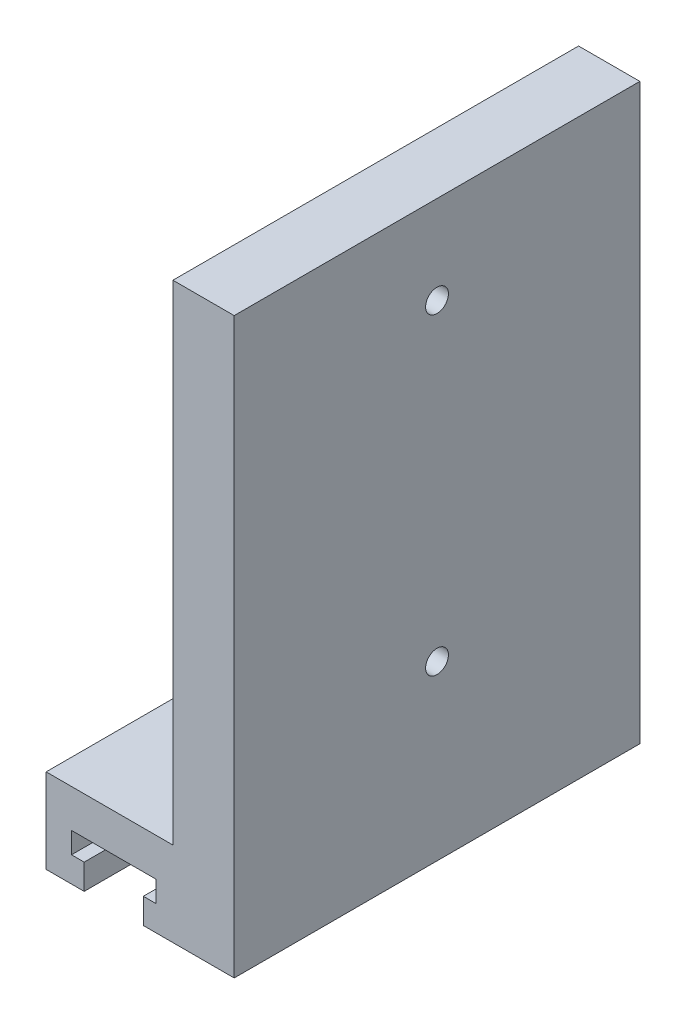
ISO-10303-21;
HEADER;
FILE_DESCRIPTION(('STEP AP214'),'2;1');
FILE_NAME('part.step','',(''),(''),'','','');
FILE_SCHEMA(('AUTOMOTIVE_DESIGN { 1 0 10303 214 1 1 1 1 }'));
ENDSEC;
DATA;
#1=APPLICATION_CONTEXT('core data for automotive mechanical design processes');
#2=APPLICATION_PROTOCOL_DEFINITION('international standard','automotive_design',2000,#1);
#3=PRODUCT_CONTEXT('',#1,'mechanical');
#4=PRODUCT('Part','Part','',(#3));
#5=PRODUCT_RELATED_PRODUCT_CATEGORY('part','',(#4));
#6=PRODUCT_DEFINITION_FORMATION('','',#4);
#7=PRODUCT_DEFINITION_CONTEXT('part definition',#1,'design');
#8=PRODUCT_DEFINITION('design','',#6,#7);
#9=PRODUCT_DEFINITION_SHAPE('','',#8);
#10=(LENGTH_UNIT() NAMED_UNIT(*) SI_UNIT(.MILLI.,.METRE.));
#11=(NAMED_UNIT(*) PLANE_ANGLE_UNIT() SI_UNIT($,.RADIAN.));
#12=(NAMED_UNIT(*) SI_UNIT($,.STERADIAN.) SOLID_ANGLE_UNIT());
#13=UNCERTAINTY_MEASURE_WITH_UNIT(LENGTH_MEASURE(1.E-05),#10,'distance_accuracy_value','');
#14=(GEOMETRIC_REPRESENTATION_CONTEXT(3) GLOBAL_UNCERTAINTY_ASSIGNED_CONTEXT((#13)) GLOBAL_UNIT_ASSIGNED_CONTEXT((#10,
#11,#12)) REPRESENTATION_CONTEXT('',''));
#15=CARTESIAN_POINT('',(0.,0.,0.));
#16=DIRECTION('',(0.,0.,1.));
#17=DIRECTION('',(1.,0.,0.));
#18=AXIS2_PLACEMENT_3D('',#15,#16,#17);
#19=CARTESIAN_POINT('',(-8.,13.,-38.));
#20=DIRECTION('',(-1.,0.,0.));
#21=DIRECTION('',(0.,0.,1.));
#22=AXIS2_PLACEMENT_3D('',#19,#20,#21);
#23=PLANE('',#22);
#24=DIRECTION('',(0.,-1.,0.));
#25=VECTOR('',#24,1.);
#26=CARTESIAN_POINT('',(-8.,13.,10.));
#27=LINE('',#26,#25);
#28=CARTESIAN_POINT('',(-8.,23.,10.));
#29=VERTEX_POINT('',#28);
#30=CARTESIAN_POINT('',(-8.,13.,10.));
#31=VERTEX_POINT('',#30);
#32=EDGE_CURVE('E170',#29,#31,#27,.T.);
#33=ORIENTED_EDGE('',*,*,#32,.F.);
#34=DIRECTION('',(0.,0.,1.));
#35=VECTOR('',#34,1.);
#36=CARTESIAN_POINT('',(-8.,23.,-38.));
#37=LINE('',#36,#35);
#38=CARTESIAN_POINT('',(-8.,23.,-38.));
#39=VERTEX_POINT('',#38);
#40=EDGE_CURVE('E11',#39,#29,#37,.T.);
#41=ORIENTED_EDGE('',*,*,#40,.F.);
#42=DIRECTION('',(0.,-1.,0.));
#43=VECTOR('',#42,1.);
#44=CARTESIAN_POINT('',(-8.,13.,-38.));
#45=LINE('',#44,#43);
#46=CARTESIAN_POINT('',(-8.,13.,-38.));
#47=VERTEX_POINT('',#46);
#48=EDGE_CURVE('E209',#39,#47,#45,.T.);
#49=ORIENTED_EDGE('',*,*,#48,.T.);
#50=DIRECTION('',(0.,0.,1.));
#51=VECTOR('',#50,1.);
#52=CARTESIAN_POINT('',(-8.,13.,-38.));
#53=LINE('',#52,#51);
#54=EDGE_CURVE('E40',#47,#31,#53,.T.);
#55=ORIENTED_EDGE('',*,*,#54,.T.);
#56=EDGE_LOOP('',(#33,#41,#49,#55));
#57=FACE_BOUND('',#56,.T.);
#58=ADVANCED_FACE('F37',(#57),#23,.T.);
#59=CARTESIAN_POINT('',(-8.,23.,-38.));
#60=DIRECTION('',(0.,1.,0.));
#61=DIRECTION('',(0.,0.,1.));
#62=AXIS2_PLACEMENT_3D('',#59,#60,#61);
#63=PLANE('',#62);
#64=CARTESIAN_POINT('',(-4.14598910758457E-13,23.,-14.0000000000004));
#65=DIRECTION('',(0.,1.,0.));
#66=DIRECTION('',(0.,0.,1.));
#67=AXIS2_PLACEMENT_3D('',#64,#65,#66);
#68=CIRCLE('',#67,1.35);
#69=CARTESIAN_POINT('',(-4.14598910758457E-13,23.,-12.6500000000004));
#70=VERTEX_POINT('',#69);
#71=EDGE_CURVE('E321',#70,#70,#68,.T.);
#72=ORIENTED_EDGE('',*,*,#71,.F.);
#73=EDGE_LOOP('',(#72));
#74=FACE_BOUND('',#73,.T.);
#75=DIRECTION('',(-1.,0.,0.));
#76=VECTOR('',#75,1.);
#77=CARTESIAN_POINT('',(-8.,23.,10.));
#78=LINE('',#77,#76);
#79=CARTESIAN_POINT('',(7.,23.,10.));
#80=VERTEX_POINT('',#79);
#81=EDGE_CURVE('E207',#80,#29,#78,.T.);
#82=ORIENTED_EDGE('',*,*,#81,.F.);
#83=DIRECTION('',(0.,0.,1.));
#84=VECTOR('',#83,1.);
#85=CARTESIAN_POINT('',(7.,23.,-38.));
#86=LINE('',#85,#84);
#87=CARTESIAN_POINT('',(7.,23.,-38.));
#88=VERTEX_POINT('',#87);
#89=EDGE_CURVE('E46',#88,#80,#86,.T.);
#90=ORIENTED_EDGE('',*,*,#89,.F.);
#91=DIRECTION('',(-1.,0.,0.));
#92=VECTOR('',#91,1.);
#93=CARTESIAN_POINT('',(-8.,23.,-38.));
#94=LINE('',#93,#92);
#95=EDGE_CURVE('E160',#88,#39,#94,.T.);
#96=ORIENTED_EDGE('',*,*,#95,.T.);
#97=ORIENTED_EDGE('',*,*,#40,.T.);
#98=EDGE_LOOP('',(#82,#90,#96,#97));
#99=FACE_BOUND('',#98,.T.);
#100=ADVANCED_FACE('F233',(#74,#99),#63,.T.);
#101=CARTESIAN_POINT('',(7.,23.,-38.));
#102=DIRECTION('',(-1.,0.,0.));
#103=DIRECTION('',(0.,0.,1.));
#104=AXIS2_PLACEMENT_3D('',#101,#102,#103);
#105=PLANE('',#104);
#106=CARTESIAN_POINT('',(7.,70.44,-14.));
#107=DIRECTION('',(-1.,0.,0.));
#108=DIRECTION('',(0.,0.,1.));
#109=AXIS2_PLACEMENT_3D('',#106,#107,#108);
#110=CIRCLE('',#109,1.34999999999999);
#111=CARTESIAN_POINT('',(7.,70.44,-12.65));
#112=VERTEX_POINT('',#111);
#113=EDGE_CURVE('E311',#112,#112,#110,.T.);
#114=ORIENTED_EDGE('',*,*,#113,.F.);
#115=EDGE_LOOP('',(#114));
#116=FACE_BOUND('',#115,.T.);
#117=CARTESIAN_POINT('',(7.,33.44,-14.));
#118=DIRECTION('',(-1.,0.,0.));
#119=DIRECTION('',(0.,0.,1.));
#120=AXIS2_PLACEMENT_3D('',#117,#118,#119);
#121=CIRCLE('',#120,1.34999999999999);
#122=CARTESIAN_POINT('',(7.,33.44,-12.65));
#123=VERTEX_POINT('',#122);
#124=EDGE_CURVE('E313',#123,#123,#121,.T.);
#125=ORIENTED_EDGE('',*,*,#124,.F.);
#126=EDGE_LOOP('',(#125));
#127=FACE_BOUND('',#126,.T.);
#128=DIRECTION('',(0.,-1.,0.));
#129=VECTOR('',#128,1.);
#130=CARTESIAN_POINT('',(7.,23.,10.));
#131=LINE('',#130,#129);
#132=CARTESIAN_POINT('',(7.,80.88,10.));
#133=VERTEX_POINT('',#132);
#134=EDGE_CURVE('E147',#133,#80,#131,.T.);
#135=ORIENTED_EDGE('',*,*,#134,.F.);
#136=DIRECTION('',(0.,0.,1.));
#137=VECTOR('',#136,1.);
#138=CARTESIAN_POINT('',(7.,80.88,-38.));
#139=LINE('',#138,#137);
#140=CARTESIAN_POINT('',(7.,80.88,-38.));
#141=VERTEX_POINT('',#140);
#142=EDGE_CURVE('E142',#141,#133,#139,.T.);
#143=ORIENTED_EDGE('',*,*,#142,.F.);
#144=DIRECTION('',(0.,-1.,0.));
#145=VECTOR('',#144,1.);
#146=CARTESIAN_POINT('',(7.,23.,-38.));
#147=LINE('',#146,#145);
#148=EDGE_CURVE('E145',#141,#88,#147,.T.);
#149=ORIENTED_EDGE('',*,*,#148,.T.);
#150=ORIENTED_EDGE('',*,*,#89,.T.);
#151=EDGE_LOOP('',(#135,#143,#149,#150));
#152=FACE_BOUND('',#151,.T.);
#153=ADVANCED_FACE('F144',(#116,#127,#152),#105,.T.);
#154=CARTESIAN_POINT('',(7.,80.88,-38.));
#155=DIRECTION('',(0.,1.,0.));
#156=DIRECTION('',(0.,0.,1.));
#157=AXIS2_PLACEMENT_3D('',#154,#155,#156);
#158=PLANE('',#157);
#159=DIRECTION('',(-1.,0.,0.));
#160=VECTOR('',#159,1.);
#161=CARTESIAN_POINT('',(7.,80.88,10.));
#162=LINE('',#161,#160);
#163=CARTESIAN_POINT('',(14.25,80.88,10.));
#164=VERTEX_POINT('',#163);
#165=EDGE_CURVE('E204',#164,#133,#162,.T.);
#166=ORIENTED_EDGE('',*,*,#165,.F.);
#167=DIRECTION('',(0.,0.,1.));
#168=VECTOR('',#167,1.);
#169=CARTESIAN_POINT('',(14.25,80.88,-38.));
#170=LINE('',#169,#168);
#171=CARTESIAN_POINT('',(14.25,80.88,-38.));
#172=VERTEX_POINT('',#171);
#173=EDGE_CURVE('E152',#172,#164,#170,.T.);
#174=ORIENTED_EDGE('',*,*,#173,.F.);
#175=DIRECTION('',(-1.,0.,0.));
#176=VECTOR('',#175,1.);
#177=CARTESIAN_POINT('',(7.,80.88,-38.));
#178=LINE('',#177,#176);
#179=EDGE_CURVE('E158',#172,#141,#178,.T.);
#180=ORIENTED_EDGE('',*,*,#179,.T.);
#181=ORIENTED_EDGE('',*,*,#142,.T.);
#182=EDGE_LOOP('',(#166,#174,#180,#181));
#183=FACE_BOUND('',#182,.T.);
#184=ADVANCED_FACE('F162',(#183),#158,.T.);
#185=CARTESIAN_POINT('',(14.25,13.,-38.));
#186=DIRECTION('',(1.,0.,0.));
#187=DIRECTION('',(0.,0.,-1.));
#188=AXIS2_PLACEMENT_3D('',#185,#186,#187);
#189=PLANE('',#188);
#190=CARTESIAN_POINT('',(14.25,70.44,-14.));
#191=DIRECTION('',(-1.,0.,0.));
#192=DIRECTION('',(0.,0.,1.));
#193=AXIS2_PLACEMENT_3D('',#190,#191,#192);
#194=CIRCLE('',#193,1.35);
#195=CARTESIAN_POINT('',(14.25,70.44,-12.65));
#196=VERTEX_POINT('',#195);
#197=EDGE_CURVE('E308',#196,#196,#194,.T.);
#198=ORIENTED_EDGE('',*,*,#197,.T.);
#199=EDGE_LOOP('',(#198));
#200=FACE_BOUND('',#199,.T.);
#201=CARTESIAN_POINT('',(14.25,33.44,-14.));
#202=DIRECTION('',(-1.,0.,0.));
#203=DIRECTION('',(0.,0.,1.));
#204=AXIS2_PLACEMENT_3D('',#201,#202,#203);
#205=CIRCLE('',#204,1.35);
#206=CARTESIAN_POINT('',(14.25,33.44,-12.65));
#207=VERTEX_POINT('',#206);
#208=EDGE_CURVE('E318',#207,#207,#205,.T.);
#209=ORIENTED_EDGE('',*,*,#208,.T.);
#210=EDGE_LOOP('',(#209));
#211=FACE_BOUND('',#210,.T.);
#212=DIRECTION('',(0.,1.,0.));
#213=VECTOR('',#212,1.);
#214=CARTESIAN_POINT('',(14.25,13.,10.));
#215=LINE('',#214,#213);
#216=CARTESIAN_POINT('',(14.25,13.,10.));
#217=VERTEX_POINT('',#216);
#218=EDGE_CURVE('E201',#217,#164,#215,.T.);
#219=ORIENTED_EDGE('',*,*,#218,.F.);
#220=DIRECTION('',(0.,0.,1.));
#221=VECTOR('',#220,1.);
#222=CARTESIAN_POINT('',(14.25,13.,-38.));
#223=LINE('',#222,#221);
#224=CARTESIAN_POINT('',(14.25,13.,-38.));
#225=VERTEX_POINT('',#224);
#226=EDGE_CURVE('E213',#225,#217,#223,.T.);
#227=ORIENTED_EDGE('',*,*,#226,.F.);
#228=DIRECTION('',(0.,1.,0.));
#229=VECTOR('',#228,1.);
#230=CARTESIAN_POINT('',(14.25,13.,-38.));
#231=LINE('',#230,#229);
#232=EDGE_CURVE('E163',#225,#172,#231,.T.);
#233=ORIENTED_EDGE('',*,*,#232,.T.);
#234=ORIENTED_EDGE('',*,*,#173,.T.);
#235=EDGE_LOOP('',(#219,#227,#233,#234));
#236=FACE_BOUND('',#235,.T.);
#237=ADVANCED_FACE('F249',(#200,#211,#236),#189,.T.);
#238=CARTESIAN_POINT('',(3.5,13.,-38.));
#239=DIRECTION('',(0.,-1.,0.));
#240=DIRECTION('',(0.,0.,-1.));
#241=AXIS2_PLACEMENT_3D('',#238,#239,#240);
#242=PLANE('',#241);
#243=DIRECTION('',(1.,0.,0.));
#244=VECTOR('',#243,1.);
#245=CARTESIAN_POINT('',(3.5,13.,10.));
#246=LINE('',#245,#244);
#247=CARTESIAN_POINT('',(3.5,13.,10.));
#248=VERTEX_POINT('',#247);
#249=EDGE_CURVE('E198',#248,#217,#246,.T.);
#250=ORIENTED_EDGE('',*,*,#249,.F.);
#251=DIRECTION('',(0.,0.,1.));
#252=VECTOR('',#251,1.);
#253=CARTESIAN_POINT('',(3.5,13.,-38.));
#254=LINE('',#253,#252);
#255=CARTESIAN_POINT('',(3.5,13.,-38.));
#256=VERTEX_POINT('',#255);
#257=EDGE_CURVE('E215',#256,#248,#254,.T.);
#258=ORIENTED_EDGE('',*,*,#257,.F.);
#259=DIRECTION('',(1.,0.,0.));
#260=VECTOR('',#259,1.);
#261=CARTESIAN_POINT('',(3.5,13.,-38.));
#262=LINE('',#261,#260);
#263=EDGE_CURVE('E165',#256,#225,#262,.T.);
#264=ORIENTED_EDGE('',*,*,#263,.T.);
#265=ORIENTED_EDGE('',*,*,#226,.T.);
#266=EDGE_LOOP('',(#250,#258,#264,#265));
#267=FACE_BOUND('',#266,.T.);
#268=ADVANCED_FACE('F252',(#267),#242,.T.);
#269=CARTESIAN_POINT('',(3.5,16.,-38.));
#270=DIRECTION('',(-1.,0.,0.));
#271=DIRECTION('',(0.,-1.,0.));
#272=AXIS2_PLACEMENT_3D('',#269,#270,#271);
#273=PLANE('',#272);
#274=DIRECTION('',(0.,-1.,0.));
#275=VECTOR('',#274,1.);
#276=CARTESIAN_POINT('',(3.5,16.,10.));
#277=LINE('',#276,#275);
#278=CARTESIAN_POINT('',(3.5,16.,10.));
#279=VERTEX_POINT('',#278);
#280=EDGE_CURVE('E195',#279,#248,#277,.T.);
#281=ORIENTED_EDGE('',*,*,#280,.F.);
#282=DIRECTION('',(0.,0.,1.));
#283=VECTOR('',#282,1.);
#284=CARTESIAN_POINT('',(3.5,16.,-38.));
#285=LINE('',#284,#283);
#286=CARTESIAN_POINT('',(3.5,16.,-38.));
#287=VERTEX_POINT('',#286);
#288=EDGE_CURVE('E217',#287,#279,#285,.T.);
#289=ORIENTED_EDGE('',*,*,#288,.F.);
#290=DIRECTION('',(0.,-1.,0.));
#291=VECTOR('',#290,1.);
#292=CARTESIAN_POINT('',(3.5,16.,-38.));
#293=LINE('',#292,#291);
#294=EDGE_CURVE('E347',#287,#256,#293,.T.);
#295=ORIENTED_EDGE('',*,*,#294,.T.);
#296=ORIENTED_EDGE('',*,*,#257,.T.);
#297=EDGE_LOOP('',(#281,#289,#295,#296));
#298=FACE_BOUND('',#297,.T.);
#299=ADVANCED_FACE('F256',(#298),#273,.T.);
#300=CARTESIAN_POINT('',(5.,16.,-38.));
#301=DIRECTION('',(0.,1.,0.));
#302=DIRECTION('',(0.,0.,1.));
#303=AXIS2_PLACEMENT_3D('',#300,#301,#302);
#304=PLANE('',#303);
#305=DIRECTION('',(-1.,0.,0.));
#306=VECTOR('',#305,1.);
#307=CARTESIAN_POINT('',(5.,16.,10.));
#308=LINE('',#307,#306);
#309=CARTESIAN_POINT('',(5.,16.,10.));
#310=VERTEX_POINT('',#309);
#311=EDGE_CURVE('E192',#310,#279,#308,.T.);
#312=ORIENTED_EDGE('',*,*,#311,.F.);
#313=DIRECTION('',(0.,0.,1.));
#314=VECTOR('',#313,1.);
#315=CARTESIAN_POINT('',(5.,16.,-38.));
#316=LINE('',#315,#314);
#317=CARTESIAN_POINT('',(5.,16.,-38.));
#318=VERTEX_POINT('',#317);
#319=EDGE_CURVE('E219',#318,#310,#316,.T.);
#320=ORIENTED_EDGE('',*,*,#319,.F.);
#321=DIRECTION('',(-1.,0.,0.));
#322=VECTOR('',#321,1.);
#323=CARTESIAN_POINT('',(5.,16.,-38.));
#324=LINE('',#323,#322);
#325=EDGE_CURVE('E344',#318,#287,#324,.T.);
#326=ORIENTED_EDGE('',*,*,#325,.T.);
#327=ORIENTED_EDGE('',*,*,#288,.T.);
#328=EDGE_LOOP('',(#312,#320,#326,#327));
#329=FACE_BOUND('',#328,.T.);
#330=ADVANCED_FACE('F260',(#329),#304,.T.);
#331=CARTESIAN_POINT('',(5.,18.5,-38.));
#332=DIRECTION('',(-1.,0.,0.));
#333=DIRECTION('',(0.,0.,1.));
#334=AXIS2_PLACEMENT_3D('',#331,#332,#333);
#335=PLANE('',#334);
#336=DIRECTION('',(0.,-1.,0.));
#337=VECTOR('',#336,1.);
#338=CARTESIAN_POINT('',(5.,18.5,10.));
#339=LINE('',#338,#337);
#340=CARTESIAN_POINT('',(5.,18.5,10.));
#341=VERTEX_POINT('',#340);
#342=EDGE_CURVE('E189',#341,#310,#339,.T.);
#343=ORIENTED_EDGE('',*,*,#342,.F.);
#344=DIRECTION('',(0.,0.,1.));
#345=VECTOR('',#344,1.);
#346=CARTESIAN_POINT('',(5.,18.5,-38.));
#347=LINE('',#346,#345);
#348=CARTESIAN_POINT('',(5.,18.5,-38.));
#349=VERTEX_POINT('',#348);
#350=EDGE_CURVE('E221',#349,#341,#347,.T.);
#351=ORIENTED_EDGE('',*,*,#350,.F.);
#352=DIRECTION('',(0.,-1.,0.));
#353=VECTOR('',#352,1.);
#354=CARTESIAN_POINT('',(5.,18.5,-38.));
#355=LINE('',#354,#353);
#356=EDGE_CURVE('E341',#349,#318,#355,.T.);
#357=ORIENTED_EDGE('',*,*,#356,.T.);
#358=ORIENTED_EDGE('',*,*,#319,.T.);
#359=EDGE_LOOP('',(#343,#351,#357,#358));
#360=FACE_BOUND('',#359,.T.);
#361=ADVANCED_FACE('F264',(#360),#335,.T.);
#362=CARTESIAN_POINT('',(-5.,18.5,-38.));
#363=DIRECTION('',(0.,-1.,0.));
#364=DIRECTION('',(0.,0.,-1.));
#365=AXIS2_PLACEMENT_3D('',#362,#363,#364);
#366=PLANE('',#365);
#367=CARTESIAN_POINT('',(-4.14598910758457E-13,18.5,-14.0000000000004));
#368=DIRECTION('',(0.,-1.,0.));
#369=DIRECTION('',(0.,0.,-1.));
#370=AXIS2_PLACEMENT_3D('',#367,#368,#369);
#371=CIRCLE('',#370,1.35);
#372=CARTESIAN_POINT('',(-4.14598910758457E-13,18.5,-15.3500000000004));
#373=VERTEX_POINT('',#372);
#374=EDGE_CURVE('E174',#373,#373,#371,.T.);
#375=ORIENTED_EDGE('',*,*,#374,.F.);
#376=EDGE_LOOP('',(#375));
#377=FACE_BOUND('',#376,.T.);
#378=DIRECTION('',(1.,0.,0.));
#379=VECTOR('',#378,1.);
#380=CARTESIAN_POINT('',(-5.,18.5,10.));
#381=LINE('',#380,#379);
#382=CARTESIAN_POINT('',(-5.,18.5,10.));
#383=VERTEX_POINT('',#382);
#384=EDGE_CURVE('E186',#383,#341,#381,.T.);
#385=ORIENTED_EDGE('',*,*,#384,.F.);
#386=DIRECTION('',(0.,0.,1.));
#387=VECTOR('',#386,1.);
#388=CARTESIAN_POINT('',(-5.,18.5,-38.));
#389=LINE('',#388,#387);
#390=CARTESIAN_POINT('',(-5.,18.5,-38.));
#391=VERTEX_POINT('',#390);
#392=EDGE_CURVE('E223',#391,#383,#389,.T.);
#393=ORIENTED_EDGE('',*,*,#392,.F.);
#394=DIRECTION('',(1.,0.,0.));
#395=VECTOR('',#394,1.);
#396=CARTESIAN_POINT('',(-5.,18.5,-38.));
#397=LINE('',#396,#395);
#398=EDGE_CURVE('E338',#391,#349,#397,.T.);
#399=ORIENTED_EDGE('',*,*,#398,.T.);
#400=ORIENTED_EDGE('',*,*,#350,.T.);
#401=EDGE_LOOP('',(#385,#393,#399,#400));
#402=FACE_BOUND('',#401,.T.);
#403=ADVANCED_FACE('F268',(#377,#402),#366,.T.);
#404=CARTESIAN_POINT('',(-5.,16.,-38.));
#405=DIRECTION('',(1.,0.,0.));
#406=DIRECTION('',(0.,0.,-1.));
#407=AXIS2_PLACEMENT_3D('',#404,#405,#406);
#408=PLANE('',#407);
#409=DIRECTION('',(0.,1.,0.));
#410=VECTOR('',#409,1.);
#411=CARTESIAN_POINT('',(-5.,16.,10.));
#412=LINE('',#411,#410);
#413=CARTESIAN_POINT('',(-5.,16.,10.));
#414=VERTEX_POINT('',#413);
#415=EDGE_CURVE('E183',#414,#383,#412,.T.);
#416=ORIENTED_EDGE('',*,*,#415,.F.);
#417=DIRECTION('',(0.,0.,1.));
#418=VECTOR('',#417,1.);
#419=CARTESIAN_POINT('',(-5.,16.,-38.));
#420=LINE('',#419,#418);
#421=CARTESIAN_POINT('',(-5.,16.,-38.));
#422=VERTEX_POINT('',#421);
#423=EDGE_CURVE('E225',#422,#414,#420,.T.);
#424=ORIENTED_EDGE('',*,*,#423,.F.);
#425=DIRECTION('',(0.,1.,0.));
#426=VECTOR('',#425,1.);
#427=CARTESIAN_POINT('',(-5.,16.,-38.));
#428=LINE('',#427,#426);
#429=EDGE_CURVE('E335',#422,#391,#428,.T.);
#430=ORIENTED_EDGE('',*,*,#429,.T.);
#431=ORIENTED_EDGE('',*,*,#392,.T.);
#432=EDGE_LOOP('',(#416,#424,#430,#431));
#433=FACE_BOUND('',#432,.T.);
#434=ADVANCED_FACE('F272',(#433),#408,.T.);
#435=CARTESIAN_POINT('',(-3.5,16.,-38.));
#436=DIRECTION('',(0.,1.,0.));
#437=DIRECTION('',(0.,0.,1.));
#438=AXIS2_PLACEMENT_3D('',#435,#436,#437);
#439=PLANE('',#438);
#440=DIRECTION('',(-1.,0.,0.));
#441=VECTOR('',#440,1.);
#442=CARTESIAN_POINT('',(-3.5,16.,10.));
#443=LINE('',#442,#441);
#444=CARTESIAN_POINT('',(-3.5,16.,10.));
#445=VERTEX_POINT('',#444);
#446=EDGE_CURVE('E180',#445,#414,#443,.T.);
#447=ORIENTED_EDGE('',*,*,#446,.F.);
#448=DIRECTION('',(0.,0.,1.));
#449=VECTOR('',#448,1.);
#450=CARTESIAN_POINT('',(-3.5,16.,-38.));
#451=LINE('',#450,#449);
#452=CARTESIAN_POINT('',(-3.5,16.,-38.));
#453=VERTEX_POINT('',#452);
#454=EDGE_CURVE('E227',#453,#445,#451,.T.);
#455=ORIENTED_EDGE('',*,*,#454,.F.);
#456=DIRECTION('',(-1.,0.,0.));
#457=VECTOR('',#456,1.);
#458=CARTESIAN_POINT('',(-3.5,16.,-38.));
#459=LINE('',#458,#457);
#460=EDGE_CURVE('E332',#453,#422,#459,.T.);
#461=ORIENTED_EDGE('',*,*,#460,.T.);
#462=ORIENTED_EDGE('',*,*,#423,.T.);
#463=EDGE_LOOP('',(#447,#455,#461,#462));
#464=FACE_BOUND('',#463,.T.);
#465=ADVANCED_FACE('F276',(#464),#439,.T.);
#466=CARTESIAN_POINT('',(-3.5,13.,-38.));
#467=DIRECTION('',(1.,0.,0.));
#468=DIRECTION('',(0.,0.,-1.));
#469=AXIS2_PLACEMENT_3D('',#466,#467,#468);
#470=PLANE('',#469);
#471=DIRECTION('',(0.,1.,0.));
#472=VECTOR('',#471,1.);
#473=CARTESIAN_POINT('',(-3.5,13.,10.));
#474=LINE('',#473,#472);
#475=CARTESIAN_POINT('',(-3.5,13.,10.));
#476=VERTEX_POINT('',#475);
#477=EDGE_CURVE('E177',#476,#445,#474,.T.);
#478=ORIENTED_EDGE('',*,*,#477,.F.);
#479=DIRECTION('',(0.,0.,1.));
#480=VECTOR('',#479,1.);
#481=CARTESIAN_POINT('',(-3.5,13.,-38.));
#482=LINE('',#481,#480);
#483=CARTESIAN_POINT('',(-3.5,13.,-38.));
#484=VERTEX_POINT('',#483);
#485=EDGE_CURVE('E228',#484,#476,#482,.T.);
#486=ORIENTED_EDGE('',*,*,#485,.F.);
#487=DIRECTION('',(0.,1.,0.));
#488=VECTOR('',#487,1.);
#489=CARTESIAN_POINT('',(-3.5,13.,-38.));
#490=LINE('',#489,#488);
#491=EDGE_CURVE('E329',#484,#453,#490,.T.);
#492=ORIENTED_EDGE('',*,*,#491,.T.);
#493=ORIENTED_EDGE('',*,*,#454,.T.);
#494=EDGE_LOOP('',(#478,#486,#492,#493));
#495=FACE_BOUND('',#494,.T.);
#496=ADVANCED_FACE('F280',(#495),#470,.T.);
#497=CARTESIAN_POINT('',(-8.,13.,-38.));
#498=DIRECTION('',(0.,-1.,0.));
#499=DIRECTION('',(0.,0.,-1.));
#500=AXIS2_PLACEMENT_3D('',#497,#498,#499);
#501=PLANE('',#500);
#502=DIRECTION('',(1.,0.,0.));
#503=VECTOR('',#502,1.);
#504=CARTESIAN_POINT('',(-8.,13.,10.));
#505=LINE('',#504,#503);
#506=EDGE_CURVE('E173',#31,#476,#505,.T.);
#507=ORIENTED_EDGE('',*,*,#506,.F.);
#508=ORIENTED_EDGE('',*,*,#54,.F.);
#509=DIRECTION('',(1.,0.,0.));
#510=VECTOR('',#509,1.);
#511=CARTESIAN_POINT('',(-8.,13.,-38.));
#512=LINE('',#511,#510);
#513=EDGE_CURVE('E327',#47,#484,#512,.T.);
#514=ORIENTED_EDGE('',*,*,#513,.T.);
#515=ORIENTED_EDGE('',*,*,#485,.T.);
#516=EDGE_LOOP('',(#507,#508,#514,#515));
#517=FACE_BOUND('',#516,.T.);
#518=ADVANCED_FACE('F230',(#517),#501,.T.);
#519=CARTESIAN_POINT('',(0.,0.,-38.));
#520=DIRECTION('',(0.,0.,-1.));
#521=DIRECTION('',(-1.,0.,0.));
#522=AXIS2_PLACEMENT_3D('',#519,#520,#521);
#523=PLANE('',#522);
#524=ORIENTED_EDGE('',*,*,#48,.F.);
#525=ORIENTED_EDGE('',*,*,#95,.F.);
#526=ORIENTED_EDGE('',*,*,#148,.F.);
#527=ORIENTED_EDGE('',*,*,#179,.F.);
#528=ORIENTED_EDGE('',*,*,#232,.F.);
#529=ORIENTED_EDGE('',*,*,#263,.F.);
#530=ORIENTED_EDGE('',*,*,#294,.F.);
#531=ORIENTED_EDGE('',*,*,#325,.F.);
#532=ORIENTED_EDGE('',*,*,#356,.F.);
#533=ORIENTED_EDGE('',*,*,#398,.F.);
#534=ORIENTED_EDGE('',*,*,#429,.F.);
#535=ORIENTED_EDGE('',*,*,#460,.F.);
#536=ORIENTED_EDGE('',*,*,#491,.F.);
#537=ORIENTED_EDGE('',*,*,#513,.F.);
#538=EDGE_LOOP('',(#524,#525,#526,#527,#528,#529,#530,#531,#532,#533,#534,#535,#536,#537));
#539=FACE_BOUND('',#538,.T.);
#540=ADVANCED_FACE('F156',(#539),#523,.T.);
#541=CARTESIAN_POINT('',(0.,0.,10.));
#542=DIRECTION('',(0.,0.,-1.));
#543=DIRECTION('',(-1.,0.,0.));
#544=AXIS2_PLACEMENT_3D('',#541,#542,#543);
#545=PLANE('',#544);
#546=ORIENTED_EDGE('',*,*,#32,.T.);
#547=ORIENTED_EDGE('',*,*,#506,.T.);
#548=ORIENTED_EDGE('',*,*,#477,.T.);
#549=ORIENTED_EDGE('',*,*,#446,.T.);
#550=ORIENTED_EDGE('',*,*,#415,.T.);
#551=ORIENTED_EDGE('',*,*,#384,.T.);
#552=ORIENTED_EDGE('',*,*,#342,.T.);
#553=ORIENTED_EDGE('',*,*,#311,.T.);
#554=ORIENTED_EDGE('',*,*,#280,.T.);
#555=ORIENTED_EDGE('',*,*,#249,.T.);
#556=ORIENTED_EDGE('',*,*,#218,.T.);
#557=ORIENTED_EDGE('',*,*,#165,.T.);
#558=ORIENTED_EDGE('',*,*,#134,.T.);
#559=ORIENTED_EDGE('',*,*,#81,.T.);
#560=EDGE_LOOP('',(#546,#547,#548,#549,#550,#551,#552,#553,#554,#555,#556,#557,#558,#559));
#561=FACE_BOUND('',#560,.T.);
#562=ADVANCED_FACE('F232',(#561),#545,.F.);
#563=CARTESIAN_POINT('',(-4.14598910758457E-13,23.,-14.0000000000004));
#564=DIRECTION('',(0.,1.,0.));
#565=DIRECTION('',(0.,0.,1.));
#566=AXIS2_PLACEMENT_3D('',#563,#564,#565);
#567=CYLINDRICAL_SURFACE('',#566,1.35);
#568=ORIENTED_EDGE('',*,*,#374,.T.);
#569=EDGE_LOOP('',(#568));
#570=FACE_BOUND('',#569,.T.);
#571=ORIENTED_EDGE('',*,*,#71,.T.);
#572=EDGE_LOOP('',(#571));
#573=FACE_BOUND('',#572,.T.);
#574=ADVANCED_FACE('F291',(#570,#573),#567,.F.);
#575=CARTESIAN_POINT('',(7.,33.44,-14.));
#576=DIRECTION('',(-1.,0.,0.));
#577=DIRECTION('',(0.,0.,1.));
#578=AXIS2_PLACEMENT_3D('',#575,#576,#577);
#579=CYLINDRICAL_SURFACE('',#578,1.34999999999999);
#580=ORIENTED_EDGE('',*,*,#208,.F.);
#581=EDGE_LOOP('',(#580));
#582=FACE_BOUND('',#581,.T.);
#583=ORIENTED_EDGE('',*,*,#124,.T.);
#584=EDGE_LOOP('',(#583));
#585=FACE_BOUND('',#584,.T.);
#586=ADVANCED_FACE('F295',(#582,#585),#579,.F.);
#587=CARTESIAN_POINT('',(7.,70.44,-14.));
#588=DIRECTION('',(-1.,0.,0.));
#589=DIRECTION('',(0.,0.,1.));
#590=AXIS2_PLACEMENT_3D('',#587,#588,#589);
#591=CYLINDRICAL_SURFACE('',#590,1.35);
#592=ORIENTED_EDGE('',*,*,#197,.F.);
#593=EDGE_LOOP('',(#592));
#594=FACE_BOUND('',#593,.T.);
#595=ORIENTED_EDGE('',*,*,#113,.T.);
#596=EDGE_LOOP('',(#595));
#597=FACE_BOUND('',#596,.T.);
#598=ADVANCED_FACE('F299',(#594,#597),#591,.F.);
#599=CLOSED_SHELL('',(#58,#100,#153,#184,#237,#268,#299,#330,#361,#403,#434,#465,#496,#518,#540,
#562,#574,#586,#598));
#600=MANIFOLD_SOLID_BREP('B2',#599);
#601=ADVANCED_BREP_SHAPE_REPRESENTATION('',(#18,#600),#14);
#602=SHAPE_DEFINITION_REPRESENTATION(#9,#601);
ENDSEC;
END-ISO-10303-21;
